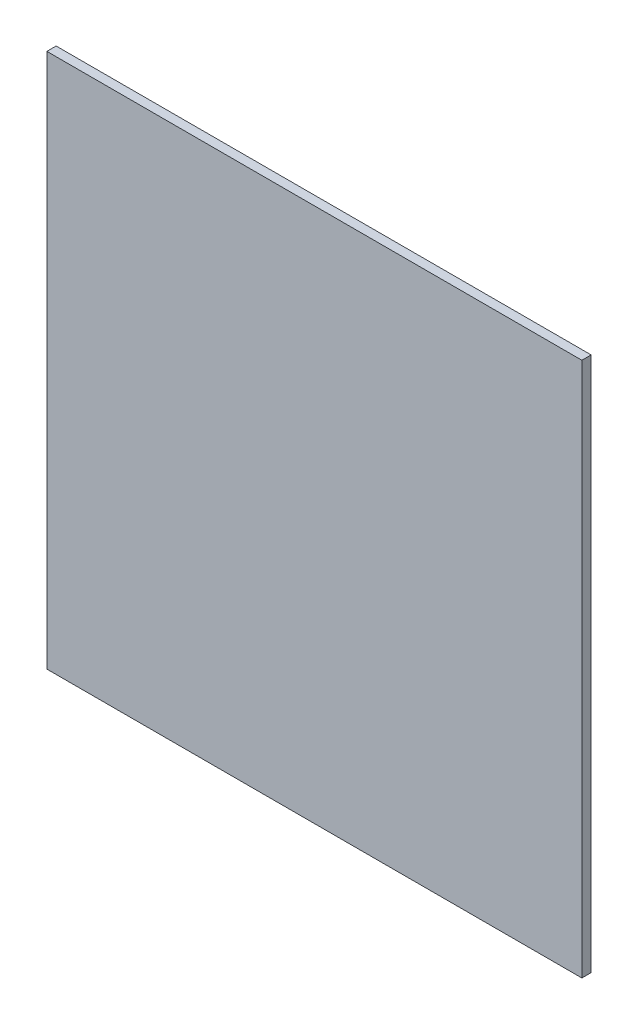
ISO-10303-21;
HEADER;
FILE_DESCRIPTION(('STEP AP214'),'2;1');
FILE_NAME('part.step','',(''),(''),'','','');
FILE_SCHEMA(('AUTOMOTIVE_DESIGN { 1 0 10303 214 1 1 1 1 }'));
ENDSEC;
DATA;
#1=APPLICATION_CONTEXT('core data for automotive mechanical design processes');
#2=APPLICATION_PROTOCOL_DEFINITION('international standard','automotive_design',2000,#1);
#3=PRODUCT_CONTEXT('',#1,'mechanical');
#4=PRODUCT('Part','Part','',(#3));
#5=PRODUCT_RELATED_PRODUCT_CATEGORY('part','',(#4));
#6=PRODUCT_DEFINITION_FORMATION('','',#4);
#7=PRODUCT_DEFINITION_CONTEXT('part definition',#1,'design');
#8=PRODUCT_DEFINITION('design','',#6,#7);
#9=PRODUCT_DEFINITION_SHAPE('','',#8);
#10=(LENGTH_UNIT() NAMED_UNIT(*) SI_UNIT(.MILLI.,.METRE.));
#11=(NAMED_UNIT(*) PLANE_ANGLE_UNIT() SI_UNIT($,.RADIAN.));
#12=(NAMED_UNIT(*) SI_UNIT($,.STERADIAN.) SOLID_ANGLE_UNIT());
#13=UNCERTAINTY_MEASURE_WITH_UNIT(LENGTH_MEASURE(1.E-05),#10,'distance_accuracy_value','');
#14=(GEOMETRIC_REPRESENTATION_CONTEXT(3) GLOBAL_UNCERTAINTY_ASSIGNED_CONTEXT((#13)) GLOBAL_UNIT_ASSIGNED_CONTEXT((#10,
#11,#12)) REPRESENTATION_CONTEXT('',''));
#15=CARTESIAN_POINT('',(0.,0.,0.));
#16=DIRECTION('',(0.,0.,1.));
#17=DIRECTION('',(1.,0.,0.));
#18=AXIS2_PLACEMENT_3D('',#15,#16,#17);
#19=CARTESIAN_POINT('',(550.,-550.,19.05));
#20=DIRECTION('',(-1.,0.,0.));
#21=DIRECTION('',(0.,0.,1.));
#22=AXIS2_PLACEMENT_3D('',#19,#20,#21);
#23=PLANE('',#22);
#24=DIRECTION('',(0.,1.,0.));
#25=VECTOR('',#24,1.);
#26=CARTESIAN_POINT('',(550.,-550.,0.));
#27=LINE('',#26,#25);
#28=CARTESIAN_POINT('',(550.,-550.,0.));
#29=VERTEX_POINT('',#28);
#30=CARTESIAN_POINT('',(550.,550.,0.));
#31=VERTEX_POINT('',#30);
#32=EDGE_CURVE('E96',#29,#31,#27,.T.);
#33=ORIENTED_EDGE('',*,*,#32,.T.);
#34=DIRECTION('',(0.,0.,-1.));
#35=VECTOR('',#34,1.);
#36=CARTESIAN_POINT('',(550.,550.,19.05));
#37=LINE('',#36,#35);
#38=CARTESIAN_POINT('',(550.,550.,19.05));
#39=VERTEX_POINT('',#38);
#40=EDGE_CURVE('E11',#39,#31,#37,.T.);
#41=ORIENTED_EDGE('',*,*,#40,.F.);
#42=DIRECTION('',(0.,1.,0.));
#43=VECTOR('',#42,1.);
#44=CARTESIAN_POINT('',(550.,-550.,19.05));
#45=LINE('',#44,#43);
#46=CARTESIAN_POINT('',(550.,-550.,19.05));
#47=VERTEX_POINT('',#46);
#48=EDGE_CURVE('E84',#47,#39,#45,.T.);
#49=ORIENTED_EDGE('',*,*,#48,.F.);
#50=DIRECTION('',(0.,0.,-1.));
#51=VECTOR('',#50,1.);
#52=CARTESIAN_POINT('',(550.,-550.,19.05));
#53=LINE('',#52,#51);
#54=EDGE_CURVE('E92',#47,#29,#53,.T.);
#55=ORIENTED_EDGE('',*,*,#54,.T.);
#56=EDGE_LOOP('',(#33,#41,#49,#55));
#57=FACE_BOUND('',#56,.T.);
#58=ADVANCED_FACE('F33',(#57),#23,.F.);
#59=CARTESIAN_POINT('',(-550.,550.,19.05));
#60=DIRECTION('',(0.,-1.,0.));
#61=DIRECTION('',(0.,0.,-1.));
#62=AXIS2_PLACEMENT_3D('',#59,#60,#61);
#63=PLANE('',#62);
#64=DIRECTION('',(-1.,0.,0.));
#65=VECTOR('',#64,1.);
#66=CARTESIAN_POINT('',(-550.,550.,0.));
#67=LINE('',#66,#65);
#68=CARTESIAN_POINT('',(-550.,550.,0.));
#69=VERTEX_POINT('',#68);
#70=EDGE_CURVE('E88',#31,#69,#67,.T.);
#71=ORIENTED_EDGE('',*,*,#70,.T.);
#72=DIRECTION('',(0.,0.,-1.));
#73=VECTOR('',#72,1.);
#74=CARTESIAN_POINT('',(-550.,550.,19.05));
#75=LINE('',#74,#73);
#76=CARTESIAN_POINT('',(-550.,550.,19.05));
#77=VERTEX_POINT('',#76);
#78=EDGE_CURVE('E41',#77,#69,#75,.T.);
#79=ORIENTED_EDGE('',*,*,#78,.F.);
#80=DIRECTION('',(-1.,0.,0.));
#81=VECTOR('',#80,1.);
#82=CARTESIAN_POINT('',(-550.,550.,19.05));
#83=LINE('',#82,#81);
#84=EDGE_CURVE('E79',#39,#77,#83,.T.);
#85=ORIENTED_EDGE('',*,*,#84,.F.);
#86=ORIENTED_EDGE('',*,*,#40,.T.);
#87=EDGE_LOOP('',(#71,#79,#85,#86));
#88=FACE_BOUND('',#87,.T.);
#89=ADVANCED_FACE('F87',(#88),#63,.F.);
#90=CARTESIAN_POINT('',(-550.,-550.,19.05));
#91=DIRECTION('',(1.,0.,0.));
#92=DIRECTION('',(0.,0.,-1.));
#93=AXIS2_PLACEMENT_3D('',#90,#91,#92);
#94=PLANE('',#93);
#95=DIRECTION('',(0.,-1.,0.));
#96=VECTOR('',#95,1.);
#97=CARTESIAN_POINT('',(-550.,-550.,0.));
#98=LINE('',#97,#96);
#99=CARTESIAN_POINT('',(-550.,-550.,0.));
#100=VERTEX_POINT('',#99);
#101=EDGE_CURVE('E66',#69,#100,#98,.T.);
#102=ORIENTED_EDGE('',*,*,#101,.T.);
#103=DIRECTION('',(0.,0.,-1.));
#104=VECTOR('',#103,1.);
#105=CARTESIAN_POINT('',(-550.,-550.,19.05));
#106=LINE('',#105,#104);
#107=CARTESIAN_POINT('',(-550.,-550.,19.05));
#108=VERTEX_POINT('',#107);
#109=EDGE_CURVE('E89',#108,#100,#106,.T.);
#110=ORIENTED_EDGE('',*,*,#109,.F.);
#111=DIRECTION('',(0.,-1.,0.));
#112=VECTOR('',#111,1.);
#113=CARTESIAN_POINT('',(-550.,-550.,19.05));
#114=LINE('',#113,#112);
#115=EDGE_CURVE('E82',#77,#108,#114,.T.);
#116=ORIENTED_EDGE('',*,*,#115,.F.);
#117=ORIENTED_EDGE('',*,*,#78,.T.);
#118=EDGE_LOOP('',(#102,#110,#116,#117));
#119=FACE_BOUND('',#118,.T.);
#120=ADVANCED_FACE('F90',(#119),#94,.F.);
#121=CARTESIAN_POINT('',(-550.,-550.,19.05));
#122=DIRECTION('',(0.,1.,0.));
#123=DIRECTION('',(0.,0.,1.));
#124=AXIS2_PLACEMENT_3D('',#121,#122,#123);
#125=PLANE('',#124);
#126=DIRECTION('',(1.,0.,0.));
#127=VECTOR('',#126,1.);
#128=CARTESIAN_POINT('',(-550.,-550.,0.));
#129=LINE('',#128,#127);
#130=EDGE_CURVE('E72',#100,#29,#129,.T.);
#131=ORIENTED_EDGE('',*,*,#130,.T.);
#132=ORIENTED_EDGE('',*,*,#54,.F.);
#133=DIRECTION('',(1.,0.,0.));
#134=VECTOR('',#133,1.);
#135=CARTESIAN_POINT('',(-550.,-550.,19.05));
#136=LINE('',#135,#134);
#137=EDGE_CURVE('E49',#108,#47,#136,.T.);
#138=ORIENTED_EDGE('',*,*,#137,.F.);
#139=ORIENTED_EDGE('',*,*,#109,.T.);
#140=EDGE_LOOP('',(#131,#132,#138,#139));
#141=FACE_BOUND('',#140,.T.);
#142=ADVANCED_FACE('F103',(#141),#125,.F.);
#143=CARTESIAN_POINT('',(0.,0.,19.05));
#144=DIRECTION('',(0.,0.,-1.));
#145=DIRECTION('',(-1.,0.,0.));
#146=AXIS2_PLACEMENT_3D('',#143,#144,#145);
#147=PLANE('',#146);
#148=ORIENTED_EDGE('',*,*,#48,.T.);
#149=ORIENTED_EDGE('',*,*,#84,.T.);
#150=ORIENTED_EDGE('',*,*,#115,.T.);
#151=ORIENTED_EDGE('',*,*,#137,.T.);
#152=EDGE_LOOP('',(#148,#149,#150,#151));
#153=FACE_BOUND('',#152,.T.);
#154=ADVANCED_FACE('F80',(#153),#147,.F.);
#155=CARTESIAN_POINT('',(0.,0.,0.));
#156=DIRECTION('',(0.,0.,-1.));
#157=DIRECTION('',(-1.,0.,0.));
#158=AXIS2_PLACEMENT_3D('',#155,#156,#157);
#159=PLANE('',#158);
#160=ORIENTED_EDGE('',*,*,#32,.F.);
#161=ORIENTED_EDGE('',*,*,#130,.F.);
#162=ORIENTED_EDGE('',*,*,#101,.F.);
#163=ORIENTED_EDGE('',*,*,#70,.F.);
#164=EDGE_LOOP('',(#160,#161,#162,#163));
#165=FACE_BOUND('',#164,.T.);
#166=ADVANCED_FACE('F106',(#165),#159,.T.);
#167=CLOSED_SHELL('',(#58,#89,#120,#142,#154,#166));
#168=MANIFOLD_SOLID_BREP('B2',#167);
#169=ADVANCED_BREP_SHAPE_REPRESENTATION('',(#18,#168),#14);
#170=SHAPE_DEFINITION_REPRESENTATION(#9,#169);
ENDSEC;
END-ISO-10303-21;
